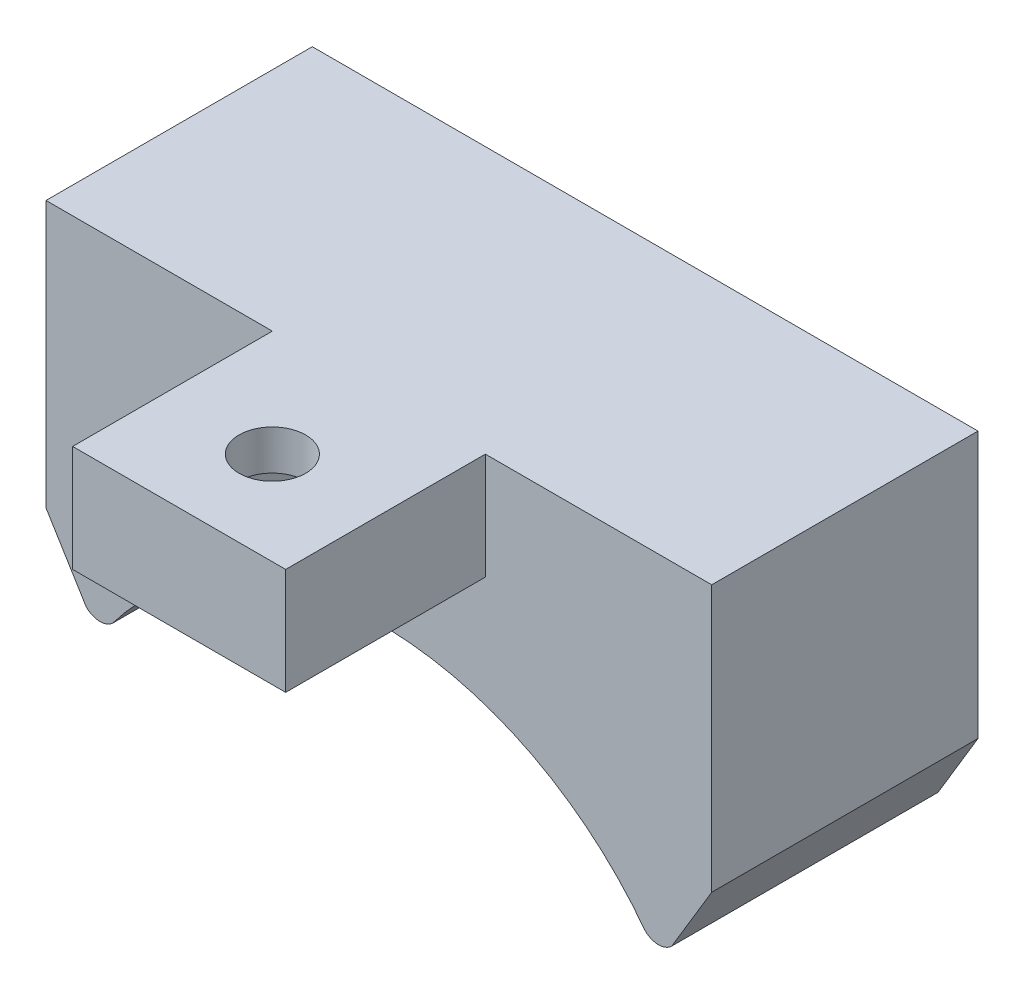
ISO-10303-21;
HEADER;
FILE_DESCRIPTION(('STEP AP214'),'2;1');
FILE_NAME('part.step','',(''),(''),'','','');
FILE_SCHEMA(('AUTOMOTIVE_DESIGN { 1 0 10303 214 1 1 1 1 }'));
ENDSEC;
DATA;
#1=APPLICATION_CONTEXT('core data for automotive mechanical design processes');
#2=APPLICATION_PROTOCOL_DEFINITION('international standard','automotive_design',2000,#1);
#3=PRODUCT_CONTEXT('',#1,'mechanical');
#4=PRODUCT('Part','Part','',(#3));
#5=PRODUCT_RELATED_PRODUCT_CATEGORY('part','',(#4));
#6=PRODUCT_DEFINITION_FORMATION('','',#4);
#7=PRODUCT_DEFINITION_CONTEXT('part definition',#1,'design');
#8=PRODUCT_DEFINITION('design','',#6,#7);
#9=PRODUCT_DEFINITION_SHAPE('','',#8);
#10=(LENGTH_UNIT() NAMED_UNIT(*) SI_UNIT(.MILLI.,.METRE.));
#11=(NAMED_UNIT(*) PLANE_ANGLE_UNIT() SI_UNIT($,.RADIAN.));
#12=(NAMED_UNIT(*) SI_UNIT($,.STERADIAN.) SOLID_ANGLE_UNIT());
#13=UNCERTAINTY_MEASURE_WITH_UNIT(LENGTH_MEASURE(1.E-05),#10,'distance_accuracy_value','');
#14=(GEOMETRIC_REPRESENTATION_CONTEXT(3) GLOBAL_UNCERTAINTY_ASSIGNED_CONTEXT((#13)) GLOBAL_UNIT_ASSIGNED_CONTEXT((#10,
#11,#12)) REPRESENTATION_CONTEXT('',''));
#15=CARTESIAN_POINT('',(0.,0.,0.));
#16=DIRECTION('',(0.,0.,1.));
#17=DIRECTION('',(1.,0.,0.));
#18=AXIS2_PLACEMENT_3D('',#15,#16,#17);
#19=CARTESIAN_POINT('',(-22.6238904906048,-13.8745051317942,20.));
#20=DIRECTION('',(0.852462729246698,0.52278800220096,0.));
#21=DIRECTION('',(-0.52278800220096,0.852462729246698,0.));
#22=AXIS2_PLACEMENT_3D('',#19,#20,#21);
#23=PLANE('',#22);
#24=DIRECTION('',(0.52278800220096,-0.852462729246698,0.));
#25=VECTOR('',#24,1.);
#26=CARTESIAN_POINT('',(-22.6238904906048,-13.8745051317942,0.));
#27=LINE('',#26,#25);
#28=CARTESIAN_POINT('',(-25.,-10.,0.));
#29=VERTEX_POINT('',#28);
#30=CARTESIAN_POINT('',(-21.9949874371066,-14.9,0.));
#31=VERTEX_POINT('',#30);
#32=EDGE_CURVE('E245',#29,#31,#27,.T.);
#33=ORIENTED_EDGE('',*,*,#32,.T.);
#34=DIRECTION('',(0.,0.,-1.));
#35=VECTOR('',#34,1.);
#36=CARTESIAN_POINT('',(-21.9949874371066,-14.9,20.));
#37=LINE('',#36,#35);
#38=CARTESIAN_POINT('',(-21.9949874371066,-14.9,20.));
#39=VERTEX_POINT('',#38);
#40=EDGE_CURVE('E11',#39,#31,#37,.T.);
#41=ORIENTED_EDGE('',*,*,#40,.F.);
#42=DIRECTION('',(0.52278800220096,-0.852462729246698,0.));
#43=VECTOR('',#42,1.);
#44=CARTESIAN_POINT('',(-22.6238904906048,-13.8745051317942,20.));
#45=LINE('',#44,#43);
#46=CARTESIAN_POINT('',(-25.,-10.,20.));
#47=VERTEX_POINT('',#46);
#48=EDGE_CURVE('E246',#47,#39,#45,.T.);
#49=ORIENTED_EDGE('',*,*,#48,.F.);
#50=DIRECTION('',(0.,0.,-1.));
#51=VECTOR('',#50,1.);
#52=CARTESIAN_POINT('',(-25.,-10.,20.));
#53=LINE('',#52,#51);
#54=EDGE_CURVE('E267',#47,#29,#53,.T.);
#55=ORIENTED_EDGE('',*,*,#54,.T.);
#56=EDGE_LOOP('',(#33,#41,#49,#55));
#57=FACE_BOUND('',#56,.T.);
#58=ADVANCED_FACE('F38',(#57),#23,.F.);
#59=CARTESIAN_POINT('',(-20.9474937185533,-13.9525062814467,20.));
#60=DIRECTION('',(0.,0.,-1.));
#61=DIRECTION('',(-1.,0.,0.));
#62=AXIS2_PLACEMENT_3D('',#59,#60,#61);
#63=CYLINDRICAL_SURFACE('',#62,1.4124402419595);
#64=CARTESIAN_POINT('',(-20.9474937185533,-13.9525062814467,0.));
#65=DIRECTION('',(0.,0.,1.));
#66=DIRECTION('',(1.,0.,0.));
#67=AXIS2_PLACEMENT_3D('',#64,#65,#66);
#68=CIRCLE('',#67,1.4124402419595);
#69=CARTESIAN_POINT('',(-20.,-15.,0.));
#70=VERTEX_POINT('',#69);
#71=EDGE_CURVE('E270',#31,#70,#68,.T.);
#72=ORIENTED_EDGE('',*,*,#71,.T.);
#73=DIRECTION('',(0.,0.,-1.));
#74=VECTOR('',#73,1.);
#75=CARTESIAN_POINT('',(-20.,-15.,20.));
#76=LINE('',#75,#74);
#77=CARTESIAN_POINT('',(-20.,-15.,20.));
#78=VERTEX_POINT('',#77);
#79=EDGE_CURVE('E45',#78,#70,#76,.T.);
#80=ORIENTED_EDGE('',*,*,#79,.F.);
#81=CARTESIAN_POINT('',(-20.9474937185533,-13.9525062814467,20.));
#82=DIRECTION('',(0.,0.,1.));
#83=DIRECTION('',(1.,0.,0.));
#84=AXIS2_PLACEMENT_3D('',#81,#82,#83);
#85=CIRCLE('',#84,1.4124402419595);
#86=EDGE_CURVE('E249',#39,#78,#85,.T.);
#87=ORIENTED_EDGE('',*,*,#86,.F.);
#88=ORIENTED_EDGE('',*,*,#40,.T.);
#89=EDGE_LOOP('',(#72,#80,#87,#88));
#90=FACE_BOUND('',#89,.T.);
#91=ADVANCED_FACE('F324',(#90),#63,.T.);
#92=CARTESIAN_POINT('',(0.,-30.0083042092767,20.));
#93=DIRECTION('',(0.,0.,-1.));
#94=DIRECTION('',(-1.,0.,0.));
#95=AXIS2_PLACEMENT_3D('',#92,#93,#94);
#96=CYLINDRICAL_SURFACE('',#95,25.0049834080767);
#97=CARTESIAN_POINT('',(0.,-30.0083042092767,0.));
#98=DIRECTION('',(0.,0.,1.));
#99=DIRECTION('',(1.,0.,0.));
#100=AXIS2_PLACEMENT_3D('',#97,#98,#99);
#101=CIRCLE('',#100,25.0049834080767);
#102=CARTESIAN_POINT('',(20.,-15.,0.));
#103=VERTEX_POINT('',#102);
#104=EDGE_CURVE('E272',#70,#103,#101,.F.);
#105=ORIENTED_EDGE('',*,*,#104,.T.);
#106=DIRECTION('',(0.,0.,-1.));
#107=VECTOR('',#106,1.);
#108=CARTESIAN_POINT('',(20.,-15.,20.));
#109=LINE('',#108,#107);
#110=CARTESIAN_POINT('',(20.,-15.,20.));
#111=VERTEX_POINT('',#110);
#112=EDGE_CURVE('E297',#111,#103,#109,.T.);
#113=ORIENTED_EDGE('',*,*,#112,.F.);
#114=CARTESIAN_POINT('',(0.,-30.0083042092767,20.));
#115=DIRECTION('',(0.,0.,1.));
#116=DIRECTION('',(1.,0.,0.));
#117=AXIS2_PLACEMENT_3D('',#114,#115,#116);
#118=CIRCLE('',#117,25.0049834080767);
#119=EDGE_CURVE('E252',#78,#111,#118,.F.);
#120=ORIENTED_EDGE('',*,*,#119,.F.);
#121=ORIENTED_EDGE('',*,*,#79,.T.);
#122=EDGE_LOOP('',(#105,#113,#120,#121));
#123=FACE_BOUND('',#122,.T.);
#124=ADVANCED_FACE('F304',(#123),#96,.F.);
#125=CARTESIAN_POINT('',(21.,-14.,20.));
#126=DIRECTION('',(0.,0.,-1.));
#127=DIRECTION('',(-1.,0.,0.));
#128=AXIS2_PLACEMENT_3D('',#125,#126,#127);
#129=CYLINDRICAL_SURFACE('',#128,1.4142135623731);
#130=CARTESIAN_POINT('',(21.,-14.,0.));
#131=DIRECTION('',(0.,0.,1.));
#132=DIRECTION('',(1.,0.,0.));
#133=AXIS2_PLACEMENT_3D('',#130,#131,#132);
#134=CIRCLE('',#133,1.4142135623731);
#135=CARTESIAN_POINT('',(22.,-15.,0.));
#136=VERTEX_POINT('',#135);
#137=EDGE_CURVE('E274',#103,#136,#134,.T.);
#138=ORIENTED_EDGE('',*,*,#137,.T.);
#139=DIRECTION('',(0.,0.,-1.));
#140=VECTOR('',#139,1.);
#141=CARTESIAN_POINT('',(22.,-15.,20.));
#142=LINE('',#141,#140);
#143=CARTESIAN_POINT('',(22.,-15.,20.));
#144=VERTEX_POINT('',#143);
#145=EDGE_CURVE('E294',#144,#136,#142,.T.);
#146=ORIENTED_EDGE('',*,*,#145,.F.);
#147=CARTESIAN_POINT('',(21.,-14.,20.));
#148=DIRECTION('',(0.,0.,1.));
#149=DIRECTION('',(1.,0.,0.));
#150=AXIS2_PLACEMENT_3D('',#147,#148,#149);
#151=CIRCLE('',#150,1.4142135623731);
#152=EDGE_CURVE('E254',#111,#144,#151,.T.);
#153=ORIENTED_EDGE('',*,*,#152,.F.);
#154=ORIENTED_EDGE('',*,*,#112,.T.);
#155=EDGE_LOOP('',(#138,#146,#153,#154));
#156=FACE_BOUND('',#155,.T.);
#157=ADVANCED_FACE('F314',(#156),#129,.T.);
#158=CARTESIAN_POINT('',(22.7941176470588,-13.6764705882353,20.));
#159=DIRECTION('',(-0.857492925712544,0.514495755427527,0.));
#160=DIRECTION('',(-0.514495755427527,-0.857492925712544,0.));
#161=AXIS2_PLACEMENT_3D('',#158,#159,#160);
#162=PLANE('',#161);
#163=DIRECTION('',(0.514495755427527,0.857492925712544,0.));
#164=VECTOR('',#163,1.);
#165=CARTESIAN_POINT('',(22.7941176470588,-13.6764705882353,0.));
#166=LINE('',#165,#164);
#167=CARTESIAN_POINT('',(25.,-10.,0.));
#168=VERTEX_POINT('',#167);
#169=EDGE_CURVE('E276',#136,#168,#166,.T.);
#170=ORIENTED_EDGE('',*,*,#169,.T.);
#171=DIRECTION('',(0.,0.,-1.));
#172=VECTOR('',#171,1.);
#173=CARTESIAN_POINT('',(25.,-10.,20.));
#174=LINE('',#173,#172);
#175=CARTESIAN_POINT('',(25.,-10.,20.));
#176=VERTEX_POINT('',#175);
#177=EDGE_CURVE('E292',#176,#168,#174,.T.);
#178=ORIENTED_EDGE('',*,*,#177,.F.);
#179=DIRECTION('',(0.514495755427527,0.857492925712544,0.));
#180=VECTOR('',#179,1.);
#181=CARTESIAN_POINT('',(22.7941176470588,-13.6764705882353,20.));
#182=LINE('',#181,#180);
#183=EDGE_CURVE('E256',#144,#176,#182,.T.);
#184=ORIENTED_EDGE('',*,*,#183,.F.);
#185=ORIENTED_EDGE('',*,*,#145,.T.);
#186=EDGE_LOOP('',(#170,#178,#184,#185));
#187=FACE_BOUND('',#186,.T.);
#188=ADVANCED_FACE('F318',(#187),#162,.F.);
#189=CARTESIAN_POINT('',(25.,0.,20.));
#190=DIRECTION('',(1.,0.,0.));
#191=DIRECTION('',(0.,1.,0.));
#192=AXIS2_PLACEMENT_3D('',#189,#190,#191);
#193=PLANE('',#192);
#194=DIRECTION('',(0.,-1.,0.));
#195=VECTOR('',#194,1.);
#196=CARTESIAN_POINT('',(25.,0.,0.));
#197=LINE('',#196,#195);
#198=CARTESIAN_POINT('',(25.,10.,0.));
#199=VERTEX_POINT('',#198);
#200=EDGE_CURVE('E279',#199,#168,#197,.T.);
#201=ORIENTED_EDGE('',*,*,#200,.F.);
#202=DIRECTION('',(0.,0.,-1.));
#203=VECTOR('',#202,1.);
#204=CARTESIAN_POINT('',(25.,10.,20.));
#205=LINE('',#204,#203);
#206=CARTESIAN_POINT('',(25.,10.,20.));
#207=VERTEX_POINT('',#206);
#208=EDGE_CURVE('E290',#207,#199,#205,.T.);
#209=ORIENTED_EDGE('',*,*,#208,.F.);
#210=DIRECTION('',(0.,-1.,0.));
#211=VECTOR('',#210,1.);
#212=CARTESIAN_POINT('',(25.,0.,20.));
#213=LINE('',#212,#211);
#214=EDGE_CURVE('E258',#207,#176,#213,.T.);
#215=ORIENTED_EDGE('',*,*,#214,.T.);
#216=ORIENTED_EDGE('',*,*,#177,.T.);
#217=EDGE_LOOP('',(#201,#209,#215,#216));
#218=FACE_BOUND('',#217,.T.);
#219=ADVANCED_FACE('F336',(#218),#193,.T.);
#220=CARTESIAN_POINT('',(0.,10.,20.));
#221=DIRECTION('',(0.,1.,0.));
#222=DIRECTION('',(0.,0.,1.));
#223=AXIS2_PLACEMENT_3D('',#220,#221,#222);
#224=PLANE('',#223);
#225=CARTESIAN_POINT('',(0.,10.,28.0000124404503));
#226=DIRECTION('',(0.,1.,0.));
#227=DIRECTION('',(0.,0.,1.));
#228=AXIS2_PLACEMENT_3D('',#225,#226,#227);
#229=CIRCLE('',#228,2.5);
#230=CARTESIAN_POINT('',(0.,10.,30.5000124404503));
#231=VERTEX_POINT('',#230);
#232=EDGE_CURVE('E189',#231,#231,#229,.F.);
#233=ORIENTED_EDGE('',*,*,#232,.T.);
#234=EDGE_LOOP('',(#233));
#235=FACE_BOUND('',#234,.T.);
#236=DIRECTION('',(1.,0.,0.));
#237=VECTOR('',#236,1.);
#238=CARTESIAN_POINT('',(0.,10.,0.));
#239=LINE('',#238,#237);
#240=CARTESIAN_POINT('',(-25.,10.,0.));
#241=VERTEX_POINT('',#240);
#242=EDGE_CURVE('E282',#241,#199,#239,.T.);
#243=ORIENTED_EDGE('',*,*,#242,.F.);
#244=DIRECTION('',(0.,0.,-1.));
#245=VECTOR('',#244,1.);
#246=CARTESIAN_POINT('',(-25.,10.,20.));
#247=LINE('',#246,#245);
#248=CARTESIAN_POINT('',(-25.,10.,20.));
#249=VERTEX_POINT('',#248);
#250=EDGE_CURVE('E288',#249,#241,#247,.T.);
#251=ORIENTED_EDGE('',*,*,#250,.F.);
#252=DIRECTION('',(1.,0.,0.));
#253=VECTOR('',#252,1.);
#254=CARTESIAN_POINT('',(0.,10.,20.));
#255=LINE('',#254,#253);
#256=CARTESIAN_POINT('',(-8.,10.,20.));
#257=VERTEX_POINT('',#256);
#258=EDGE_CURVE('E262',#249,#257,#255,.T.);
#259=ORIENTED_EDGE('',*,*,#258,.T.);
#260=DIRECTION('',(0.,0.,-1.));
#261=VECTOR('',#260,1.);
#262=CARTESIAN_POINT('',(-8.,10.,35.));
#263=LINE('',#262,#261);
#264=CARTESIAN_POINT('',(-8.,10.,35.));
#265=VERTEX_POINT('',#264);
#266=EDGE_CURVE('E242',#265,#257,#263,.T.);
#267=ORIENTED_EDGE('',*,*,#266,.F.);
#268=DIRECTION('',(-1.,0.,0.));
#269=VECTOR('',#268,1.);
#270=CARTESIAN_POINT('',(8.,10.,35.));
#271=LINE('',#270,#269);
#272=CARTESIAN_POINT('',(8.,10.,35.));
#273=VERTEX_POINT('',#272);
#274=EDGE_CURVE('E220',#273,#265,#271,.T.);
#275=ORIENTED_EDGE('',*,*,#274,.F.);
#276=DIRECTION('',(0.,0.,-1.));
#277=VECTOR('',#276,1.);
#278=CARTESIAN_POINT('',(8.,10.,35.));
#279=LINE('',#278,#277);
#280=CARTESIAN_POINT('',(8.,10.,20.));
#281=VERTEX_POINT('',#280);
#282=EDGE_CURVE('E228',#273,#281,#279,.T.);
#283=ORIENTED_EDGE('',*,*,#282,.T.);
#284=EDGE_CURVE('E261',#281,#207,#255,.T.);
#285=ORIENTED_EDGE('',*,*,#284,.T.);
#286=ORIENTED_EDGE('',*,*,#208,.T.);
#287=EDGE_LOOP('',(#243,#251,#259,#267,#275,#283,#285,#286));
#288=FACE_BOUND('',#287,.T.);
#289=ADVANCED_FACE('F331',(#235,#288),#224,.T.);
#290=CARTESIAN_POINT('',(-25.,0.,20.));
#291=DIRECTION('',(1.,0.,0.));
#292=DIRECTION('',(0.,1.,0.));
#293=AXIS2_PLACEMENT_3D('',#290,#291,#292);
#294=PLANE('',#293);
#295=DIRECTION('',(0.,-1.,0.));
#296=VECTOR('',#295,1.);
#297=CARTESIAN_POINT('',(-25.,0.,0.));
#298=LINE('',#297,#296);
#299=EDGE_CURVE('E250',#241,#29,#298,.T.);
#300=ORIENTED_EDGE('',*,*,#299,.T.);
#301=ORIENTED_EDGE('',*,*,#54,.F.);
#302=DIRECTION('',(0.,-1.,0.));
#303=VECTOR('',#302,1.);
#304=CARTESIAN_POINT('',(-25.,0.,20.));
#305=LINE('',#304,#303);
#306=EDGE_CURVE('E265',#249,#47,#305,.T.);
#307=ORIENTED_EDGE('',*,*,#306,.F.);
#308=ORIENTED_EDGE('',*,*,#250,.T.);
#309=EDGE_LOOP('',(#300,#301,#307,#308));
#310=FACE_BOUND('',#309,.T.);
#311=ADVANCED_FACE('F343',(#310),#294,.F.);
#312=CARTESIAN_POINT('',(0.,0.,20.));
#313=DIRECTION('',(0.,0.,1.));
#314=DIRECTION('',(1.,0.,0.));
#315=AXIS2_PLACEMENT_3D('',#312,#313,#314);
#316=PLANE('',#315);
#317=DIRECTION('',(0.,1.,0.));
#318=VECTOR('',#317,1.);
#319=CARTESIAN_POINT('',(8.,2.00000000000001,20.));
#320=LINE('',#319,#318);
#321=CARTESIAN_POINT('',(8.,2.00000000000001,20.));
#322=VERTEX_POINT('',#321);
#323=EDGE_CURVE('E60',#322,#281,#320,.T.);
#324=ORIENTED_EDGE('',*,*,#323,.F.);
#325=DIRECTION('',(1.,0.,0.));
#326=VECTOR('',#325,1.);
#327=CARTESIAN_POINT('',(-8.,2.00000000000001,20.));
#328=LINE('',#327,#326);
#329=CARTESIAN_POINT('',(-8.,2.00000000000001,20.));
#330=VERTEX_POINT('',#329);
#331=EDGE_CURVE('E231',#330,#322,#328,.T.);
#332=ORIENTED_EDGE('',*,*,#331,.F.);
#333=DIRECTION('',(0.,-1.,0.));
#334=VECTOR('',#333,1.);
#335=CARTESIAN_POINT('',(-8.,10.,20.));
#336=LINE('',#335,#334);
#337=EDGE_CURVE('E212',#257,#330,#336,.T.);
#338=ORIENTED_EDGE('',*,*,#337,.F.);
#339=ORIENTED_EDGE('',*,*,#258,.F.);
#340=ORIENTED_EDGE('',*,*,#306,.T.);
#341=ORIENTED_EDGE('',*,*,#48,.T.);
#342=ORIENTED_EDGE('',*,*,#86,.T.);
#343=ORIENTED_EDGE('',*,*,#119,.T.);
#344=ORIENTED_EDGE('',*,*,#152,.T.);
#345=ORIENTED_EDGE('',*,*,#183,.T.);
#346=ORIENTED_EDGE('',*,*,#214,.F.);
#347=ORIENTED_EDGE('',*,*,#284,.F.);
#348=EDGE_LOOP('',(#324,#332,#338,#339,#340,#341,#342,#343,#344,#345,#346,#347));
#349=FACE_BOUND('',#348,.T.);
#350=ADVANCED_FACE('F321',(#349),#316,.T.);
#351=CARTESIAN_POINT('',(0.,0.,0.));
#352=DIRECTION('',(0.,0.,1.));
#353=DIRECTION('',(1.,0.,0.));
#354=AXIS2_PLACEMENT_3D('',#351,#352,#353);
#355=PLANE('',#354);
#356=ORIENTED_EDGE('',*,*,#32,.F.);
#357=ORIENTED_EDGE('',*,*,#299,.F.);
#358=ORIENTED_EDGE('',*,*,#242,.T.);
#359=ORIENTED_EDGE('',*,*,#200,.T.);
#360=ORIENTED_EDGE('',*,*,#169,.F.);
#361=ORIENTED_EDGE('',*,*,#137,.F.);
#362=ORIENTED_EDGE('',*,*,#104,.F.);
#363=ORIENTED_EDGE('',*,*,#71,.F.);
#364=EDGE_LOOP('',(#356,#357,#358,#359,#360,#361,#362,#363));
#365=FACE_BOUND('',#364,.T.);
#366=ADVANCED_FACE('F310',(#365),#355,.F.);
#367=CARTESIAN_POINT('',(-8.,10.,35.));
#368=DIRECTION('',(1.,0.,0.));
#369=DIRECTION('',(0.,1.,0.));
#370=AXIS2_PLACEMENT_3D('',#367,#368,#369);
#371=PLANE('',#370);
#372=ORIENTED_EDGE('',*,*,#337,.T.);
#373=DIRECTION('',(0.,0.,-1.));
#374=VECTOR('',#373,1.);
#375=CARTESIAN_POINT('',(-8.,2.00000000000001,35.));
#376=LINE('',#375,#374);
#377=CARTESIAN_POINT('',(-8.,2.00000000000001,35.));
#378=VERTEX_POINT('',#377);
#379=EDGE_CURVE('E239',#378,#330,#376,.T.);
#380=ORIENTED_EDGE('',*,*,#379,.F.);
#381=DIRECTION('',(0.,-1.,0.));
#382=VECTOR('',#381,1.);
#383=CARTESIAN_POINT('',(-8.,10.,35.));
#384=LINE('',#383,#382);
#385=EDGE_CURVE('E222',#265,#378,#384,.T.);
#386=ORIENTED_EDGE('',*,*,#385,.F.);
#387=ORIENTED_EDGE('',*,*,#266,.T.);
#388=EDGE_LOOP('',(#372,#380,#386,#387));
#389=FACE_BOUND('',#388,.T.);
#390=ADVANCED_FACE('F389',(#389),#371,.F.);
#391=CARTESIAN_POINT('',(-8.,2.00000000000001,35.));
#392=DIRECTION('',(0.,1.,0.));
#393=DIRECTION('',(0.,0.,1.));
#394=AXIS2_PLACEMENT_3D('',#391,#392,#393);
#395=PLANE('',#394);
#396=DIRECTION('',(0.497903126972163,0.,0.867232653992769));
#397=VECTOR('',#396,1.);
#398=CARTESIAN_POINT('',(2.45728637139281,2.00000000000001,23.7559494338791));
#399=LINE('',#398,#397);
#400=CARTESIAN_POINT('',(2.45728637139281,2.00000000000001,23.7559494338791));
#401=VERTEX_POINT('',#400);
#402=CARTESIAN_POINT('',(4.90073465868856,2.00000000000001,28.0118739868575));
#403=VERTEX_POINT('',#402);
#404=EDGE_CURVE('E200',#401,#403,#399,.T.);
#405=ORIENTED_EDGE('',*,*,#404,.F.);
#406=DIRECTION('',(0.99999707283522,0.,0.00241957041478247));
#407=VECTOR('',#406,1.);
#408=CARTESIAN_POINT('',(-2.45017655172433,2.00000000000001,23.7440754470216));
#409=LINE('',#408,#407);
#410=CARTESIAN_POINT('',(-2.45017655172433,2.00000000000001,23.7440754470216));
#411=VERTEX_POINT('',#410);
#412=EDGE_CURVE('E52',#411,#401,#409,.T.);
#413=ORIENTED_EDGE('',*,*,#412,.F.);
#414=DIRECTION('',(0.502093945863057,0.,-0.864813083577987));
#415=VECTOR('',#414,1.);
#416=CARTESIAN_POINT('',(-4.91419118754573,2.00000000000001,27.9881260131425));
#417=LINE('',#416,#415);
#418=CARTESIAN_POINT('',(-4.91419118754573,2.00000000000001,27.9881260131425));
#419=VERTEX_POINT('',#418);
#420=EDGE_CURVE('E183',#419,#411,#417,.T.);
#421=ORIENTED_EDGE('',*,*,#420,.F.);
#422=DIRECTION('',(-0.497903126972163,0.,-0.867232653992769));
#423=VECTOR('',#422,1.);
#424=CARTESIAN_POINT('',(-2.47074290024998,2.00000000000001,32.2440505661209));
#425=LINE('',#424,#423);
#426=CARTESIAN_POINT('',(-2.47074290024998,2.00000000000001,32.2440505661209));
#427=VERTEX_POINT('',#426);
#428=EDGE_CURVE('E186',#427,#419,#425,.T.);
#429=ORIENTED_EDGE('',*,*,#428,.F.);
#430=DIRECTION('',(-0.99999707283522,0.,-0.00241957041478176));
#431=VECTOR('',#430,1.);
#432=CARTESIAN_POINT('',(2.43672002286716,2.00000000000001,32.2559245529785));
#433=LINE('',#432,#431);
#434=CARTESIAN_POINT('',(2.43672002286716,2.00000000000001,32.2559245529785));
#435=VERTEX_POINT('',#434);
#436=EDGE_CURVE('E205',#435,#427,#433,.T.);
#437=ORIENTED_EDGE('',*,*,#436,.F.);
#438=DIRECTION('',(-0.502093945863057,0.,0.864813083577987));
#439=VECTOR('',#438,1.);
#440=CARTESIAN_POINT('',(4.90073465868856,2.00000000000001,28.0118739868575));
#441=LINE('',#440,#439);
#442=EDGE_CURVE('E202',#403,#435,#441,.T.);
#443=ORIENTED_EDGE('',*,*,#442,.F.);
#444=EDGE_LOOP('',(#405,#413,#421,#429,#437,#443));
#445=FACE_BOUND('',#444,.T.);
#446=ORIENTED_EDGE('',*,*,#331,.T.);
#447=DIRECTION('',(0.,0.,-1.));
#448=VECTOR('',#447,1.);
#449=CARTESIAN_POINT('',(8.,2.00000000000001,35.));
#450=LINE('',#449,#448);
#451=CARTESIAN_POINT('',(8.,2.00000000000001,35.));
#452=VERTEX_POINT('',#451);
#453=EDGE_CURVE('E236',#452,#322,#450,.T.);
#454=ORIENTED_EDGE('',*,*,#453,.F.);
#455=DIRECTION('',(1.,0.,0.));
#456=VECTOR('',#455,1.);
#457=CARTESIAN_POINT('',(-8.,2.00000000000001,35.));
#458=LINE('',#457,#456);
#459=EDGE_CURVE('E224',#378,#452,#458,.T.);
#460=ORIENTED_EDGE('',*,*,#459,.F.);
#461=ORIENTED_EDGE('',*,*,#379,.T.);
#462=EDGE_LOOP('',(#446,#454,#460,#461));
#463=FACE_BOUND('',#462,.T.);
#464=ADVANCED_FACE('F409',(#445,#463),#395,.F.);
#465=CARTESIAN_POINT('',(8.,2.00000000000001,35.));
#466=DIRECTION('',(-1.,0.,0.));
#467=DIRECTION('',(0.,-1.,0.));
#468=AXIS2_PLACEMENT_3D('',#465,#466,#467);
#469=PLANE('',#468);
#470=ORIENTED_EDGE('',*,*,#323,.T.);
#471=ORIENTED_EDGE('',*,*,#282,.F.);
#472=DIRECTION('',(0.,1.,0.));
#473=VECTOR('',#472,1.);
#474=CARTESIAN_POINT('',(8.,2.00000000000001,35.));
#475=LINE('',#474,#473);
#476=EDGE_CURVE('E226',#452,#273,#475,.T.);
#477=ORIENTED_EDGE('',*,*,#476,.F.);
#478=ORIENTED_EDGE('',*,*,#453,.T.);
#479=EDGE_LOOP('',(#470,#471,#477,#478));
#480=FACE_BOUND('',#479,.T.);
#481=ADVANCED_FACE('F418',(#480),#469,.F.);
#482=CARTESIAN_POINT('',(0.,0.,35.));
#483=DIRECTION('',(0.,0.,1.));
#484=DIRECTION('',(1.,0.,0.));
#485=AXIS2_PLACEMENT_3D('',#482,#483,#484);
#486=PLANE('',#485);
#487=ORIENTED_EDGE('',*,*,#274,.T.);
#488=ORIENTED_EDGE('',*,*,#385,.T.);
#489=ORIENTED_EDGE('',*,*,#459,.T.);
#490=ORIENTED_EDGE('',*,*,#476,.T.);
#491=EDGE_LOOP('',(#487,#488,#489,#490));
#492=FACE_BOUND('',#491,.T.);
#493=ADVANCED_FACE('F423',(#492),#486,.T.);
#494=CARTESIAN_POINT('',(-2.45017655172433,7.00000000000001,23.7440754470216));
#495=DIRECTION('',(0.00241957041478247,0.,-0.99999707283522));
#496=DIRECTION('',(-0.99999707283522,0.,-0.00241957041478247));
#497=AXIS2_PLACEMENT_3D('',#494,#495,#496);
#498=PLANE('',#497);
#499=ORIENTED_EDGE('',*,*,#412,.T.);
#500=DIRECTION('',(0.,-1.,0.));
#501=VECTOR('',#500,1.);
#502=CARTESIAN_POINT('',(2.45728637139281,7.00000000000001,23.7559494338791));
#503=LINE('',#502,#501);
#504=CARTESIAN_POINT('',(2.45728637139281,7.00000000000001,23.7559494338791));
#505=VERTEX_POINT('',#504);
#506=EDGE_CURVE('E160',#505,#401,#503,.T.);
#507=ORIENTED_EDGE('',*,*,#506,.F.);
#508=DIRECTION('',(0.99999707283522,0.,0.00241957041478247));
#509=VECTOR('',#508,1.);
#510=CARTESIAN_POINT('',(-2.45017655172433,7.00000000000001,23.7440754470216));
#511=LINE('',#510,#509);
#512=CARTESIAN_POINT('',(-2.45017655172433,7.00000000000001,23.7440754470216));
#513=VERTEX_POINT('',#512);
#514=EDGE_CURVE('E164',#513,#505,#511,.T.);
#515=ORIENTED_EDGE('',*,*,#514,.F.);
#516=DIRECTION('',(0.,-1.,0.));
#517=VECTOR('',#516,1.);
#518=CARTESIAN_POINT('',(-2.45017655172433,7.00000000000001,23.7440754470216));
#519=LINE('',#518,#517);
#520=EDGE_CURVE('E210',#513,#411,#519,.T.);
#521=ORIENTED_EDGE('',*,*,#520,.T.);
#522=EDGE_LOOP('',(#499,#507,#515,#521));
#523=FACE_BOUND('',#522,.T.);
#524=ADVANCED_FACE('F162',(#523),#498,.F.);
#525=CARTESIAN_POINT('',(-4.91419118754573,7.00000000000001,27.9881260131425));
#526=DIRECTION('',(-0.864813083577987,0.,-0.502093945863057));
#527=DIRECTION('',(-0.502093945863057,0.,0.864813083577987));
#528=AXIS2_PLACEMENT_3D('',#525,#526,#527);
#529=PLANE('',#528);
#530=ORIENTED_EDGE('',*,*,#420,.T.);
#531=ORIENTED_EDGE('',*,*,#520,.F.);
#532=DIRECTION('',(0.502093945863057,0.,-0.864813083577987));
#533=VECTOR('',#532,1.);
#534=CARTESIAN_POINT('',(-4.91419118754573,7.00000000000001,27.9881260131425));
#535=LINE('',#534,#533);
#536=CARTESIAN_POINT('',(-4.91419118754573,7.00000000000001,27.9881260131425));
#537=VERTEX_POINT('',#536);
#538=EDGE_CURVE('E170',#537,#513,#535,.T.);
#539=ORIENTED_EDGE('',*,*,#538,.F.);
#540=DIRECTION('',(0.,-1.,0.));
#541=VECTOR('',#540,1.);
#542=CARTESIAN_POINT('',(-4.91419118754573,7.00000000000001,27.9881260131425));
#543=LINE('',#542,#541);
#544=EDGE_CURVE('E213',#537,#419,#543,.T.);
#545=ORIENTED_EDGE('',*,*,#544,.T.);
#546=EDGE_LOOP('',(#530,#531,#539,#545));
#547=FACE_BOUND('',#546,.T.);
#548=ADVANCED_FACE('F449',(#547),#529,.F.);
#549=CARTESIAN_POINT('',(-2.47074290024998,7.00000000000001,32.2440505661209));
#550=DIRECTION('',(-0.867232653992769,0.,0.497903126972163));
#551=DIRECTION('',(0.497903126972163,0.,0.867232653992769));
#552=AXIS2_PLACEMENT_3D('',#549,#550,#551);
#553=PLANE('',#552);
#554=ORIENTED_EDGE('',*,*,#428,.T.);
#555=ORIENTED_EDGE('',*,*,#544,.F.);
#556=DIRECTION('',(-0.497903126972163,0.,-0.867232653992769));
#557=VECTOR('',#556,1.);
#558=CARTESIAN_POINT('',(-2.47074290024998,7.00000000000001,32.2440505661209));
#559=LINE('',#558,#557);
#560=CARTESIAN_POINT('',(-2.47074290024998,7.00000000000001,32.2440505661209));
#561=VERTEX_POINT('',#560);
#562=EDGE_CURVE('E196',#561,#537,#559,.T.);
#563=ORIENTED_EDGE('',*,*,#562,.F.);
#564=DIRECTION('',(0.,-1.,0.));
#565=VECTOR('',#564,1.);
#566=CARTESIAN_POINT('',(-2.47074290024998,7.00000000000001,32.2440505661209));
#567=LINE('',#566,#565);
#568=EDGE_CURVE('E215',#561,#427,#567,.T.);
#569=ORIENTED_EDGE('',*,*,#568,.T.);
#570=EDGE_LOOP('',(#554,#555,#563,#569));
#571=FACE_BOUND('',#570,.T.);
#572=ADVANCED_FACE('F458',(#571),#553,.F.);
#573=CARTESIAN_POINT('',(2.43672002286716,7.00000000000001,32.2559245529785));
#574=DIRECTION('',(-0.00241957041478176,0.,0.99999707283522));
#575=DIRECTION('',(0.99999707283522,0.,0.00241957041478176));
#576=AXIS2_PLACEMENT_3D('',#573,#574,#575);
#577=PLANE('',#576);
#578=ORIENTED_EDGE('',*,*,#436,.T.);
#579=ORIENTED_EDGE('',*,*,#568,.F.);
#580=DIRECTION('',(-0.99999707283522,0.,-0.00241957041478176));
#581=VECTOR('',#580,1.);
#582=CARTESIAN_POINT('',(2.43672002286716,7.00000000000001,32.2559245529785));
#583=LINE('',#582,#581);
#584=CARTESIAN_POINT('',(2.43672002286716,7.00000000000001,32.2559245529785));
#585=VERTEX_POINT('',#584);
#586=EDGE_CURVE('E193',#585,#561,#583,.T.);
#587=ORIENTED_EDGE('',*,*,#586,.F.);
#588=DIRECTION('',(0.,-1.,0.));
#589=VECTOR('',#588,1.);
#590=CARTESIAN_POINT('',(2.43672002286716,7.00000000000001,32.2559245529785));
#591=LINE('',#590,#589);
#592=EDGE_CURVE('E217',#585,#435,#591,.T.);
#593=ORIENTED_EDGE('',*,*,#592,.T.);
#594=EDGE_LOOP('',(#578,#579,#587,#593));
#595=FACE_BOUND('',#594,.T.);
#596=ADVANCED_FACE('F468',(#595),#577,.F.);
#597=CARTESIAN_POINT('',(4.90073465868856,7.00000000000001,28.0118739868575));
#598=DIRECTION('',(0.864813083577987,0.,0.502093945863057));
#599=DIRECTION('',(0.502093945863057,0.,-0.864813083577987));
#600=AXIS2_PLACEMENT_3D('',#597,#598,#599);
#601=PLANE('',#600);
#602=ORIENTED_EDGE('',*,*,#442,.T.);
#603=ORIENTED_EDGE('',*,*,#592,.F.);
#604=DIRECTION('',(-0.502093945863057,0.,0.864813083577987));
#605=VECTOR('',#604,1.);
#606=CARTESIAN_POINT('',(4.90073465868856,7.00000000000001,28.0118739868575));
#607=LINE('',#606,#605);
#608=CARTESIAN_POINT('',(4.90073465868856,7.00000000000001,28.0118739868575));
#609=VERTEX_POINT('',#608);
#610=EDGE_CURVE('E178',#609,#585,#607,.T.);
#611=ORIENTED_EDGE('',*,*,#610,.F.);
#612=DIRECTION('',(0.,-1.,0.));
#613=VECTOR('',#612,1.);
#614=CARTESIAN_POINT('',(4.90073465868856,7.00000000000001,28.0118739868575));
#615=LINE('',#614,#613);
#616=EDGE_CURVE('E169',#609,#403,#615,.T.);
#617=ORIENTED_EDGE('',*,*,#616,.T.);
#618=EDGE_LOOP('',(#602,#603,#611,#617));
#619=FACE_BOUND('',#618,.T.);
#620=ADVANCED_FACE('F478',(#619),#601,.F.);
#621=CARTESIAN_POINT('',(2.45728637139281,7.00000000000001,23.7559494338791));
#622=DIRECTION('',(0.867232653992769,0.,-0.497903126972163));
#623=DIRECTION('',(-0.497903126972163,0.,-0.867232653992769));
#624=AXIS2_PLACEMENT_3D('',#621,#622,#623);
#625=PLANE('',#624);
#626=ORIENTED_EDGE('',*,*,#404,.T.);
#627=ORIENTED_EDGE('',*,*,#616,.F.);
#628=DIRECTION('',(0.497903126972163,0.,0.867232653992769));
#629=VECTOR('',#628,1.);
#630=CARTESIAN_POINT('',(2.45728637139281,7.00000000000001,23.7559494338791));
#631=LINE('',#630,#629);
#632=EDGE_CURVE('E173',#505,#609,#631,.T.);
#633=ORIENTED_EDGE('',*,*,#632,.F.);
#634=ORIENTED_EDGE('',*,*,#506,.T.);
#635=EDGE_LOOP('',(#626,#627,#633,#634));
#636=FACE_BOUND('',#635,.T.);
#637=ADVANCED_FACE('F174',(#636),#625,.F.);
#638=CARTESIAN_POINT('',(0.,7.00000000000001,0.));
#639=DIRECTION('',(0.,-1.,0.));
#640=DIRECTION('',(0.,0.,-1.));
#641=AXIS2_PLACEMENT_3D('',#638,#639,#640);
#642=PLANE('',#641);
#643=CARTESIAN_POINT('',(0.,7.00000000000001,28.0000124404503));
#644=DIRECTION('',(0.,-1.,0.));
#645=DIRECTION('',(0.,0.,-1.));
#646=AXIS2_PLACEMENT_3D('',#643,#644,#645);
#647=CIRCLE('',#646,2.5);
#648=CARTESIAN_POINT('',(0.,7.00000000000001,25.5000124404503));
#649=VERTEX_POINT('',#648);
#650=EDGE_CURVE('E527',#649,#649,#647,.T.);
#651=ORIENTED_EDGE('',*,*,#650,.F.);
#652=EDGE_LOOP('',(#651));
#653=FACE_BOUND('',#652,.T.);
#654=ORIENTED_EDGE('',*,*,#514,.T.);
#655=ORIENTED_EDGE('',*,*,#632,.T.);
#656=ORIENTED_EDGE('',*,*,#610,.T.);
#657=ORIENTED_EDGE('',*,*,#586,.T.);
#658=ORIENTED_EDGE('',*,*,#562,.T.);
#659=ORIENTED_EDGE('',*,*,#538,.T.);
#660=EDGE_LOOP('',(#654,#655,#656,#657,#658,#659));
#661=FACE_BOUND('',#660,.T.);
#662=ADVANCED_FACE('F180',(#653,#661),#642,.T.);
#663=CARTESIAN_POINT('',(0.,17.0710678118655,28.0000124404503));
#664=DIRECTION('',(0.,-1.,0.));
#665=DIRECTION('',(0.,0.,-1.));
#666=AXIS2_PLACEMENT_3D('',#663,#664,#665);
#667=CYLINDRICAL_SURFACE('',#666,2.5);
#668=ORIENTED_EDGE('',*,*,#650,.T.);
#669=EDGE_LOOP('',(#668));
#670=FACE_BOUND('',#669,.T.);
#671=ORIENTED_EDGE('',*,*,#232,.F.);
#672=EDGE_LOOP('',(#671));
#673=FACE_BOUND('',#672,.T.);
#674=ADVANCED_FACE('F510',(#670,#673),#667,.F.);
#675=CLOSED_SHELL('',(#58,#91,#124,#157,#188,#219,#289,#311,#350,#366,#390,#464,#481,#493,#524,
#548,#572,#596,#620,#637,#662,#674));
#676=MANIFOLD_SOLID_BREP('B2',#675);
#677=ADVANCED_BREP_SHAPE_REPRESENTATION('',(#18,#676),#14);
#678=SHAPE_DEFINITION_REPRESENTATION(#9,#677);
ENDSEC;
END-ISO-10303-21;
